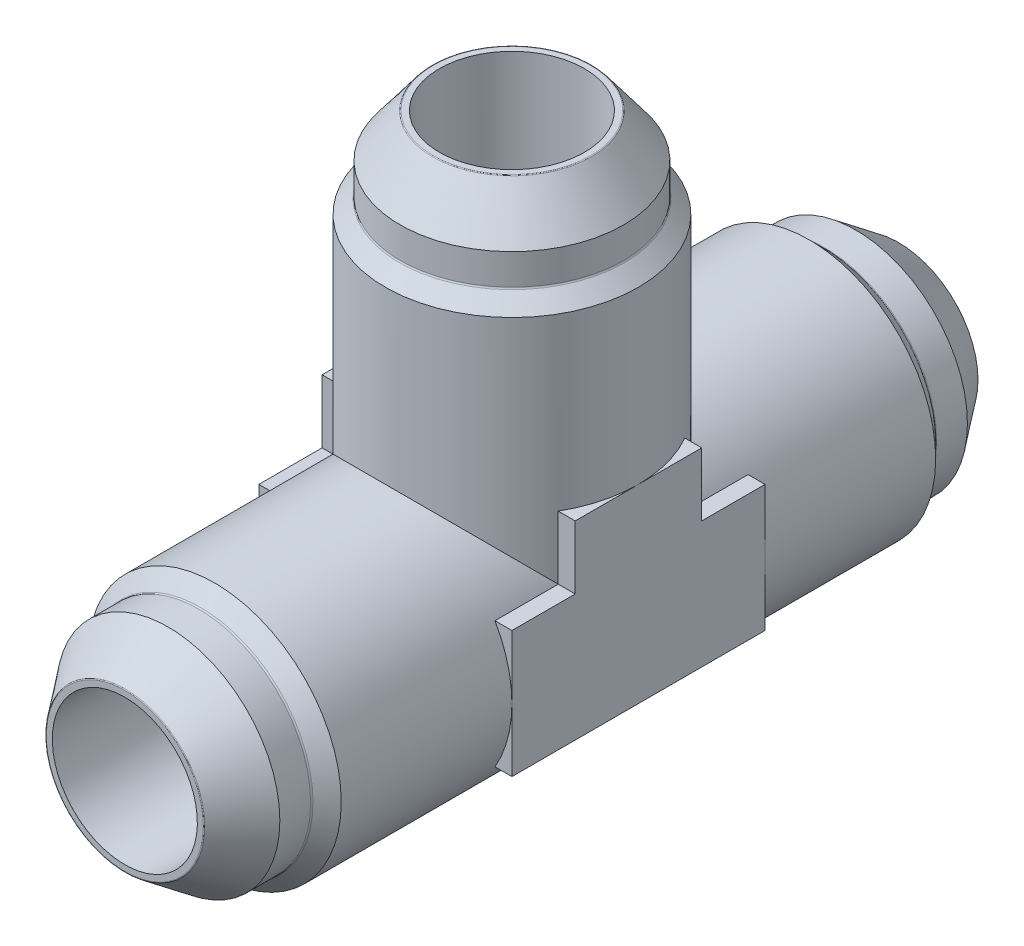
ISO-10303-21;
HEADER;
FILE_DESCRIPTION(('STEP AP214'),'2;1');
FILE_NAME('part.step','',(''),(''),'','','');
FILE_SCHEMA(('AUTOMOTIVE_DESIGN { 1 0 10303 214 1 1 1 1 }'));
ENDSEC;
DATA;
#1=APPLICATION_CONTEXT('core data for automotive mechanical design processes');
#2=APPLICATION_PROTOCOL_DEFINITION('international standard','automotive_design',2000,#1);
#3=PRODUCT_CONTEXT('',#1,'mechanical');
#4=PRODUCT('Part','Part','',(#3));
#5=PRODUCT_RELATED_PRODUCT_CATEGORY('part','',(#4));
#6=PRODUCT_DEFINITION_FORMATION('','',#4);
#7=PRODUCT_DEFINITION_CONTEXT('part definition',#1,'design');
#8=PRODUCT_DEFINITION('design','',#6,#7);
#9=PRODUCT_DEFINITION_SHAPE('','',#8);
#10=(LENGTH_UNIT() NAMED_UNIT(*) SI_UNIT(.MILLI.,.METRE.));
#11=(NAMED_UNIT(*) PLANE_ANGLE_UNIT() SI_UNIT($,.RADIAN.));
#12=(NAMED_UNIT(*) SI_UNIT($,.STERADIAN.) SOLID_ANGLE_UNIT());
#13=UNCERTAINTY_MEASURE_WITH_UNIT(LENGTH_MEASURE(1.E-05),#10,'distance_accuracy_value','');
#14=(GEOMETRIC_REPRESENTATION_CONTEXT(3) GLOBAL_UNCERTAINTY_ASSIGNED_CONTEXT((#13)) GLOBAL_UNIT_ASSIGNED_CONTEXT((#10,
#11,#12)) REPRESENTATION_CONTEXT('',''));
#15=CARTESIAN_POINT('',(0.,0.,0.));
#16=DIRECTION('',(0.,0.,1.));
#17=DIRECTION('',(1.,0.,0.));
#18=AXIS2_PLACEMENT_3D('',#15,#16,#17);
#19=CARTESIAN_POINT('',(0.,19.812,0.));
#20=DIRECTION('',(0.,1.,0.));
#21=DIRECTION('',(1.,0.,0.));
#22=AXIS2_PLACEMENT_3D('',#19,#20,#21);
#23=CYLINDRICAL_SURFACE('',#22,13.49375);
#24=CARTESIAN_POINT('',(0.,31.69285,-1.10654994349755E-13));
#25=DIRECTION('',(0.,1.,0.));
#26=DIRECTION('',(1.,0.,0.));
#27=AXIS2_PLACEMENT_3D('',#24,#25,#26);
#28=CIRCLE('',#27,13.49375);
#29=CARTESIAN_POINT('',(13.49375,31.69285,-1.10654994349755E-13));
#30=VERTEX_POINT('',#29);
#31=EDGE_CURVE('E321',#30,#30,#28,.T.);
#32=ORIENTED_EDGE('',*,*,#31,.F.);
#33=EDGE_LOOP('',(#32));
#34=FACE_BOUND('',#33,.T.);
#35=DIRECTION('',(0.,1.,0.));
#36=VECTOR('',#35,1.);
#37=CARTESIAN_POINT('',(11.6859302923163,19.812,-6.74687499999999));
#38=LINE('',#37,#36);
#39=CARTESIAN_POINT('',(11.6859302923163,6.74687499999998,-6.746875));
#40=VERTEX_POINT('',#39);
#41=CARTESIAN_POINT('',(11.6859302923163,13.49375,-6.746875));
#42=VERTEX_POINT('',#41);
#43=EDGE_CURVE('E274',#40,#42,#38,.T.);
#44=ORIENTED_EDGE('',*,*,#43,.F.);
#45=CARTESIAN_POINT('',(0.,0.,0.));
#46=DIRECTION('',(0.,0.707106781186549,0.707106781186546));
#47=DIRECTION('',(0.,0.707106781186546,-0.707106781186549));
#48=AXIS2_PLACEMENT_3D('',#45,#46,#47);
#49=ELLIPSE('',#48,19.083044257272,13.49375);
#50=CARTESIAN_POINT('',(-11.6859302923163,6.74687499999998,-6.746875));
#51=VERTEX_POINT('',#50);
#52=EDGE_CURVE('E312',#51,#40,#49,.F.);
#53=ORIENTED_EDGE('',*,*,#52,.F.);
#54=DIRECTION('',(0.,1.,0.));
#55=VECTOR('',#54,1.);
#56=CARTESIAN_POINT('',(-11.6859302923163,19.812,-6.74687499999999));
#57=LINE('',#56,#55);
#58=CARTESIAN_POINT('',(-11.6859302923163,13.49375,-6.746875));
#59=VERTEX_POINT('',#58);
#60=EDGE_CURVE('E271',#59,#51,#57,.F.);
#61=ORIENTED_EDGE('',*,*,#60,.F.);
#62=CARTESIAN_POINT('',(0.,13.49375,0.));
#63=DIRECTION('',(0.,-1.,0.));
#64=DIRECTION('',(0.,0.,-1.));
#65=AXIS2_PLACEMENT_3D('',#62,#63,#64);
#66=CIRCLE('',#65,13.49375);
#67=CARTESIAN_POINT('',(-13.49375,13.49375,0.));
#68=VERTEX_POINT('',#67);
#69=EDGE_CURVE('E364',#68,#59,#66,.T.);
#70=ORIENTED_EDGE('',*,*,#69,.F.);
#71=CARTESIAN_POINT('',(-11.6859302923162,13.49375,6.74687500000002));
#72=VERTEX_POINT('',#71);
#73=EDGE_CURVE('E57',#72,#68,#66,.T.);
#74=ORIENTED_EDGE('',*,*,#73,.F.);
#75=DIRECTION('',(0.,1.,0.));
#76=VECTOR('',#75,1.);
#77=CARTESIAN_POINT('',(-11.6859302923162,19.812,6.746875));
#78=LINE('',#77,#76);
#79=CARTESIAN_POINT('',(-11.6859302923163,6.746875,6.74687499999998));
#80=VERTEX_POINT('',#79);
#81=EDGE_CURVE('E269',#80,#72,#78,.T.);
#82=ORIENTED_EDGE('',*,*,#81,.F.);
#83=CARTESIAN_POINT('',(0.,0.,0.));
#84=DIRECTION('',(0.,0.707106781186546,-0.707106781186549));
#85=DIRECTION('',(0.,0.707106781186549,0.707106781186546));
#86=AXIS2_PLACEMENT_3D('',#83,#84,#85);
#87=ELLIPSE('',#86,19.0830442572719,13.49375);
#88=CARTESIAN_POINT('',(11.6859302923163,6.746875,6.74687499999998));
#89=VERTEX_POINT('',#88);
#90=EDGE_CURVE('E315',#89,#80,#87,.F.);
#91=ORIENTED_EDGE('',*,*,#90,.F.);
#92=DIRECTION('',(0.,1.,0.));
#93=VECTOR('',#92,1.);
#94=CARTESIAN_POINT('',(11.6859302923162,19.812,6.746875));
#95=LINE('',#94,#93);
#96=CARTESIAN_POINT('',(11.6859302923162,13.49375,6.746875));
#97=VERTEX_POINT('',#96);
#98=EDGE_CURVE('E266',#97,#89,#95,.F.);
#99=ORIENTED_EDGE('',*,*,#98,.F.);
#100=CARTESIAN_POINT('',(13.49375,13.49375,0.));
#101=VERTEX_POINT('',#100);
#102=EDGE_CURVE('E366',#101,#97,#66,.T.);
#103=ORIENTED_EDGE('',*,*,#102,.F.);
#104=EDGE_CURVE('E44',#42,#101,#66,.T.);
#105=ORIENTED_EDGE('',*,*,#104,.F.);
#106=EDGE_LOOP('',(#44,#53,#61,#70,#74,#82,#91,#99,#103,#105));
#107=FACE_BOUND('',#106,.T.);
#108=ADVANCED_FACE('F36',(#34,#107),#23,.T.);
#109=CARTESIAN_POINT('',(0.,0.,-19.812));
#110=DIRECTION('',(0.,0.,-1.));
#111=DIRECTION('',(1.,0.,0.));
#112=AXIS2_PLACEMENT_3D('',#109,#110,#111);
#113=CYLINDRICAL_SURFACE('',#112,13.49375);
#114=CARTESIAN_POINT('',(0.,0.,-31.69285));
#115=DIRECTION('',(0.,0.,-1.));
#116=DIRECTION('',(1.,0.,0.));
#117=AXIS2_PLACEMENT_3D('',#114,#115,#116);
#118=CIRCLE('',#117,13.49375);
#119=CARTESIAN_POINT('',(13.49375,0.,-31.69285));
#120=VERTEX_POINT('',#119);
#121=EDGE_CURVE('E297',#120,#120,#118,.T.);
#122=ORIENTED_EDGE('',*,*,#121,.F.);
#123=EDGE_LOOP('',(#122));
#124=FACE_BOUND('',#123,.T.);
#125=CARTESIAN_POINT('',(0.,0.,31.69285));
#126=DIRECTION('',(0.,0.,1.));
#127=DIRECTION('',(1.,0.,0.));
#128=AXIS2_PLACEMENT_3D('',#125,#126,#127);
#129=CIRCLE('',#128,13.49375);
#130=CARTESIAN_POINT('',(13.49375,0.,31.69285));
#131=VERTEX_POINT('',#130);
#132=EDGE_CURVE('E279',#131,#131,#129,.T.);
#133=ORIENTED_EDGE('',*,*,#132,.F.);
#134=EDGE_LOOP('',(#133));
#135=FACE_BOUND('',#134,.T.);
#136=CARTESIAN_POINT('',(0.,0.,-13.49375));
#137=DIRECTION('',(0.,0.,1.));
#138=DIRECTION('',(0.,-1.,0.));
#139=AXIS2_PLACEMENT_3D('',#136,#137,#138);
#140=CIRCLE('',#139,13.49375);
#141=CARTESIAN_POINT('',(-11.6859302923163,6.746875,-13.49375));
#142=VERTEX_POINT('',#141);
#143=CARTESIAN_POINT('',(-13.49375,0.,-13.49375));
#144=VERTEX_POINT('',#143);
#145=EDGE_CURVE('E348',#142,#144,#140,.T.);
#146=ORIENTED_EDGE('',*,*,#145,.F.);
#147=DIRECTION('',(0.,0.,-1.));
#148=VECTOR('',#147,1.);
#149=CARTESIAN_POINT('',(-11.6859302923163,6.746875,-19.812));
#150=LINE('',#149,#148);
#151=EDGE_CURVE('E362',#51,#142,#150,.T.);
#152=ORIENTED_EDGE('',*,*,#151,.F.);
#153=ORIENTED_EDGE('',*,*,#52,.T.);
#154=DIRECTION('',(0.,0.,-1.));
#155=VECTOR('',#154,1.);
#156=CARTESIAN_POINT('',(11.6859302923163,6.746875,-19.812));
#157=LINE('',#156,#155);
#158=CARTESIAN_POINT('',(11.6859302923163,6.746875,-13.49375));
#159=VERTEX_POINT('',#158);
#160=EDGE_CURVE('E355',#159,#40,#157,.F.);
#161=ORIENTED_EDGE('',*,*,#160,.F.);
#162=CARTESIAN_POINT('',(13.49375,0.,-13.49375));
#163=VERTEX_POINT('',#162);
#164=EDGE_CURVE('E349',#163,#159,#140,.T.);
#165=ORIENTED_EDGE('',*,*,#164,.F.);
#166=CARTESIAN_POINT('',(11.6859302923163,-6.746875,-13.49375));
#167=VERTEX_POINT('',#166);
#168=EDGE_CURVE('E358',#167,#163,#140,.T.);
#169=ORIENTED_EDGE('',*,*,#168,.F.);
#170=DIRECTION('',(0.,0.,-1.));
#171=VECTOR('',#170,1.);
#172=CARTESIAN_POINT('',(11.6859302923163,-6.74687499999999,-19.812));
#173=LINE('',#172,#171);
#174=CARTESIAN_POINT('',(11.6859302923163,-6.746875,13.49375));
#175=VERTEX_POINT('',#174);
#176=EDGE_CURVE('E352',#175,#167,#173,.T.);
#177=ORIENTED_EDGE('',*,*,#176,.F.);
#178=CARTESIAN_POINT('',(0.,0.,13.49375));
#179=DIRECTION('',(0.,0.,-1.));
#180=DIRECTION('',(0.,1.,0.));
#181=AXIS2_PLACEMENT_3D('',#178,#179,#180);
#182=CIRCLE('',#181,13.49375);
#183=CARTESIAN_POINT('',(13.49375,0.,13.49375));
#184=VERTEX_POINT('',#183);
#185=EDGE_CURVE('E456',#184,#175,#182,.T.);
#186=ORIENTED_EDGE('',*,*,#185,.F.);
#187=CARTESIAN_POINT('',(11.6859302923163,6.746875,13.49375));
#188=VERTEX_POINT('',#187);
#189=EDGE_CURVE('E340',#188,#184,#182,.T.);
#190=ORIENTED_EDGE('',*,*,#189,.F.);
#191=DIRECTION('',(0.,0.,-1.));
#192=VECTOR('',#191,1.);
#193=CARTESIAN_POINT('',(11.6859302923163,6.746875,-19.812));
#194=LINE('',#193,#192);
#195=EDGE_CURVE('E359',#89,#188,#194,.F.);
#196=ORIENTED_EDGE('',*,*,#195,.F.);
#197=ORIENTED_EDGE('',*,*,#90,.T.);
#198=DIRECTION('',(0.,0.,-1.));
#199=VECTOR('',#198,1.);
#200=CARTESIAN_POINT('',(-11.6859302923163,6.746875,-19.812));
#201=LINE('',#200,#199);
#202=CARTESIAN_POINT('',(-11.6859302923163,6.746875,13.49375));
#203=VERTEX_POINT('',#202);
#204=EDGE_CURVE('E339',#203,#80,#201,.T.);
#205=ORIENTED_EDGE('',*,*,#204,.F.);
#206=CARTESIAN_POINT('',(-13.49375,0.,13.49375));
#207=VERTEX_POINT('',#206);
#208=EDGE_CURVE('E336',#207,#203,#182,.T.);
#209=ORIENTED_EDGE('',*,*,#208,.F.);
#210=CARTESIAN_POINT('',(-11.6859302923163,-6.746875,13.49375));
#211=VERTEX_POINT('',#210);
#212=EDGE_CURVE('E341',#211,#207,#182,.T.);
#213=ORIENTED_EDGE('',*,*,#212,.F.);
#214=DIRECTION('',(0.,0.,-1.));
#215=VECTOR('',#214,1.);
#216=CARTESIAN_POINT('',(-11.6859302923163,-6.74687499999999,-19.812));
#217=LINE('',#216,#215);
#218=CARTESIAN_POINT('',(-11.6859302923163,-6.746875,-13.49375));
#219=VERTEX_POINT('',#218);
#220=EDGE_CURVE('E347',#219,#211,#217,.F.);
#221=ORIENTED_EDGE('',*,*,#220,.F.);
#222=EDGE_CURVE('E344',#144,#219,#140,.T.);
#223=ORIENTED_EDGE('',*,*,#222,.F.);
#224=EDGE_LOOP('',(#146,#152,#153,#161,#165,#169,#177,#186,#190,#196,#197,#205,#209,#213,#221,#223));
#225=FACE_BOUND('',#224,.T.);
#226=ADVANCED_FACE('F399',(#124,#135,#225),#113,.T.);
#227=CARTESIAN_POINT('',(0.,41.148,-1.43667474130717E-13));
#228=DIRECTION('',(0.,1.,0.));
#229=DIRECTION('',(1.,0.,0.));
#230=AXIS2_PLACEMENT_3D('',#227,#228,#229);
#231=TOROIDAL_SURFACE('',#230,8.36948013577722,0.126999999999997);
#232=CARTESIAN_POINT('',(0.,41.275,-1.4411089226075E-13));
#233=DIRECTION('',(0.,1.,0.));
#234=DIRECTION('',(1.,0.,0.));
#235=AXIS2_PLACEMENT_3D('',#232,#233,#234);
#236=CIRCLE('',#235,8.36948013577722);
#237=CARTESIAN_POINT('',(8.36948013577722,41.275,-1.4411089226075E-13));
#238=VERTEX_POINT('',#237);
#239=EDGE_CURVE('E318',#238,#238,#236,.T.);
#240=ORIENTED_EDGE('',*,*,#239,.F.);
#241=EDGE_LOOP('',(#240));
#242=FACE_BOUND('',#241,.T.);
#243=CARTESIAN_POINT('',(0.,41.2244305079403,-1.43934329822909E-13));
#244=DIRECTION('',(0.,1.,0.));
#245=DIRECTION('',(1.,0.,0.));
#246=AXIS2_PLACEMENT_3D('',#243,#244,#245);
#247=CIRCLE('',#246,8.47090684555323);
#248=CARTESIAN_POINT('',(8.47090684555323,41.2244305079403,-1.43934329822909E-13));
#249=VERTEX_POINT('',#248);
#250=EDGE_CURVE('E333',#249,#249,#247,.T.);
#251=ORIENTED_EDGE('',*,*,#250,.T.);
#252=EDGE_LOOP('',(#251));
#253=FACE_BOUND('',#252,.T.);
#254=ADVANCED_FACE('F38',(#242,#253),#231,.T.);
#255=CARTESIAN_POINT('',(0.,36.6571494297253,-1.2798775316907E-13));
#256=DIRECTION('',(0.,-1.,0.));
#257=DIRECTION('',(-1.,0.,0.));
#258=AXIS2_PLACEMENT_3D('',#255,#256,#257);
#259=CONICAL_SURFACE('',#258,11.9126,0.645771823237904);
#260=ORIENTED_EDGE('',*,*,#250,.F.);
#261=EDGE_LOOP('',(#260));
#262=FACE_BOUND('',#261,.T.);
#263=CARTESIAN_POINT('',(0.,36.6571494297253,-1.2798775316907E-13));
#264=DIRECTION('',(0.,1.,0.));
#265=DIRECTION('',(1.,0.,0.));
#266=AXIS2_PLACEMENT_3D('',#263,#264,#265);
#267=CIRCLE('',#266,11.9126);
#268=CARTESIAN_POINT('',(11.9126,36.6571494297253,-1.2798775316907E-13));
#269=VERTEX_POINT('',#268);
#270=EDGE_CURVE('E330',#269,#269,#267,.T.);
#271=ORIENTED_EDGE('',*,*,#270,.T.);
#272=EDGE_LOOP('',(#271));
#273=FACE_BOUND('',#272,.T.);
#274=ADVANCED_FACE('F500',(#262,#273),#259,.T.);
#275=CARTESIAN_POINT('',(0.,19.812,0.));
#276=DIRECTION('',(0.,1.,0.));
#277=DIRECTION('',(1.,0.,0.));
#278=AXIS2_PLACEMENT_3D('',#275,#276,#277);
#279=CYLINDRICAL_SURFACE('',#278,11.9126);
#280=ORIENTED_EDGE('',*,*,#270,.F.);
#281=EDGE_LOOP('',(#280));
#282=FACE_BOUND('',#281,.T.);
#283=CARTESIAN_POINT('',(0.,33.3792102448428,-1.1654288967519E-13));
#284=DIRECTION('',(0.,1.,0.));
#285=DIRECTION('',(1.,0.,0.));
#286=AXIS2_PLACEMENT_3D('',#283,#284,#285);
#287=CIRCLE('',#286,11.9126);
#288=CARTESIAN_POINT('',(11.9126,33.3792102448428,-1.1654288967519E-13));
#289=VERTEX_POINT('',#288);
#290=EDGE_CURVE('E327',#289,#289,#287,.T.);
#291=ORIENTED_EDGE('',*,*,#290,.T.);
#292=EDGE_LOOP('',(#291));
#293=FACE_BOUND('',#292,.T.);
#294=ADVANCED_FACE('F497',(#282,#293),#279,.T.);
#295=CARTESIAN_POINT('',(0.,33.3792102448428,-1.1654288967519E-13));
#296=DIRECTION('',(0.,1.,0.));
#297=DIRECTION('',(1.,0.,0.));
#298=AXIS2_PLACEMENT_3D('',#295,#296,#297);
#299=TOROIDAL_SURFACE('',#298,12.1666,0.254000000000002);
#300=ORIENTED_EDGE('',*,*,#290,.F.);
#301=EDGE_LOOP('',(#300));
#302=FACE_BOUND('',#301,.T.);
#303=CARTESIAN_POINT('',(0.,33.1996051224214,-1.15915801741895E-13));
#304=DIRECTION('',(0.,1.,0.));
#305=DIRECTION('',(1.,0.,0.));
#306=AXIS2_PLACEMENT_3D('',#303,#304,#305);
#307=CIRCLE('',#306,11.9869948775786);
#308=CARTESIAN_POINT('',(11.9869948775786,33.1996051224214,-1.15915801741895E-13));
#309=VERTEX_POINT('',#308);
#310=EDGE_CURVE('E324',#309,#309,#307,.T.);
#311=ORIENTED_EDGE('',*,*,#310,.T.);
#312=EDGE_LOOP('',(#311));
#313=FACE_BOUND('',#312,.T.);
#314=ADVANCED_FACE('F493',(#302,#313),#299,.F.);
#315=CARTESIAN_POINT('',(0.,31.69285,-1.10654994349755E-13));
#316=DIRECTION('',(0.,-1.,0.));
#317=DIRECTION('',(-1.,0.,0.));
#318=AXIS2_PLACEMENT_3D('',#315,#316,#317);
#319=CONICAL_SURFACE('',#318,13.49375,0.785398163397451);
#320=ORIENTED_EDGE('',*,*,#310,.F.);
#321=EDGE_LOOP('',(#320));
#322=FACE_BOUND('',#321,.T.);
#323=ORIENTED_EDGE('',*,*,#31,.T.);
#324=EDGE_LOOP('',(#323));
#325=FACE_BOUND('',#324,.T.);
#326=ADVANCED_FACE('F490',(#322,#325),#319,.T.);
#327=CARTESIAN_POINT('',(0.,41.275,-1.4411089226075E-13));
#328=DIRECTION('',(0.,-1.,0.));
#329=DIRECTION('',(-1.,0.,0.));
#330=AXIS2_PLACEMENT_3D('',#327,#328,#329);
#331=PLANE('',#330);
#332=CARTESIAN_POINT('',(0.,41.275,-1.38410679545105E-13));
#333=DIRECTION('',(0.,-1.,0.));
#334=DIRECTION('',(0.,0.,-1.));
#335=AXIS2_PLACEMENT_3D('',#332,#333,#334);
#336=CIRCLE('',#335,7.73430000000001);
#337=CARTESIAN_POINT('',(0.,41.275,-7.73430000000014));
#338=VERTEX_POINT('',#337);
#339=EDGE_CURVE('E176',#338,#338,#336,.T.);
#340=ORIENTED_EDGE('',*,*,#339,.T.);
#341=EDGE_LOOP('',(#340));
#342=FACE_BOUND('',#341,.T.);
#343=ORIENTED_EDGE('',*,*,#239,.T.);
#344=EDGE_LOOP('',(#343));
#345=FACE_BOUND('',#344,.T.);
#346=ADVANCED_FACE('F488',(#342,#345),#331,.F.);
#347=CARTESIAN_POINT('',(0.,0.,-41.148));
#348=DIRECTION('',(0.,0.,-1.));
#349=DIRECTION('',(1.,0.,0.));
#350=AXIS2_PLACEMENT_3D('',#347,#348,#349);
#351=TOROIDAL_SURFACE('',#350,8.36948013577722,0.126999999999997);
#352=CARTESIAN_POINT('',(0.,0.,-41.275));
#353=DIRECTION('',(0.,0.,-1.));
#354=DIRECTION('',(1.,0.,0.));
#355=AXIS2_PLACEMENT_3D('',#352,#353,#354);
#356=CIRCLE('',#355,8.36948013577722);
#357=CARTESIAN_POINT('',(8.36948013577722,0.,-41.275));
#358=VERTEX_POINT('',#357);
#359=EDGE_CURVE('E294',#358,#358,#356,.T.);
#360=ORIENTED_EDGE('',*,*,#359,.F.);
#361=EDGE_LOOP('',(#360));
#362=FACE_BOUND('',#361,.T.);
#363=CARTESIAN_POINT('',(0.,0.,-41.2244305079403));
#364=DIRECTION('',(0.,0.,-1.));
#365=DIRECTION('',(1.,0.,0.));
#366=AXIS2_PLACEMENT_3D('',#363,#364,#365);
#367=CIRCLE('',#366,8.47090684555323);
#368=CARTESIAN_POINT('',(8.47090684555323,0.,-41.2244305079403));
#369=VERTEX_POINT('',#368);
#370=EDGE_CURVE('E309',#369,#369,#367,.T.);
#371=ORIENTED_EDGE('',*,*,#370,.T.);
#372=EDGE_LOOP('',(#371));
#373=FACE_BOUND('',#372,.T.);
#374=ADVANCED_FACE('F522',(#362,#373),#351,.T.);
#375=CARTESIAN_POINT('',(0.,0.,-36.6571494297253));
#376=DIRECTION('',(0.,0.,1.));
#377=DIRECTION('',(-1.,0.,0.));
#378=AXIS2_PLACEMENT_3D('',#375,#376,#377);
#379=CONICAL_SURFACE('',#378,11.9126,0.645771823237904);
#380=ORIENTED_EDGE('',*,*,#370,.F.);
#381=EDGE_LOOP('',(#380));
#382=FACE_BOUND('',#381,.T.);
#383=CARTESIAN_POINT('',(0.,0.,-36.6571494297253));
#384=DIRECTION('',(0.,0.,-1.));
#385=DIRECTION('',(1.,0.,0.));
#386=AXIS2_PLACEMENT_3D('',#383,#384,#385);
#387=CIRCLE('',#386,11.9126);
#388=CARTESIAN_POINT('',(11.9126,0.,-36.6571494297253));
#389=VERTEX_POINT('',#388);
#390=EDGE_CURVE('E306',#389,#389,#387,.T.);
#391=ORIENTED_EDGE('',*,*,#390,.T.);
#392=EDGE_LOOP('',(#391));
#393=FACE_BOUND('',#392,.T.);
#394=ADVANCED_FACE('F527',(#382,#393),#379,.T.);
#395=CARTESIAN_POINT('',(0.,0.,-19.812));
#396=DIRECTION('',(0.,0.,-1.));
#397=DIRECTION('',(1.,0.,0.));
#398=AXIS2_PLACEMENT_3D('',#395,#396,#397);
#399=CYLINDRICAL_SURFACE('',#398,11.9126);
#400=ORIENTED_EDGE('',*,*,#390,.F.);
#401=EDGE_LOOP('',(#400));
#402=FACE_BOUND('',#401,.T.);
#403=CARTESIAN_POINT('',(0.,0.,-33.3792102448428));
#404=DIRECTION('',(0.,0.,-1.));
#405=DIRECTION('',(1.,0.,0.));
#406=AXIS2_PLACEMENT_3D('',#403,#404,#405);
#407=CIRCLE('',#406,11.9126);
#408=CARTESIAN_POINT('',(11.9126,0.,-33.3792102448428));
#409=VERTEX_POINT('',#408);
#410=EDGE_CURVE('E303',#409,#409,#407,.T.);
#411=ORIENTED_EDGE('',*,*,#410,.T.);
#412=EDGE_LOOP('',(#411));
#413=FACE_BOUND('',#412,.T.);
#414=ADVANCED_FACE('F586',(#402,#413),#399,.T.);
#415=CARTESIAN_POINT('',(0.,0.,-33.3792102448428));
#416=DIRECTION('',(0.,0.,-1.));
#417=DIRECTION('',(1.,0.,0.));
#418=AXIS2_PLACEMENT_3D('',#415,#416,#417);
#419=TOROIDAL_SURFACE('',#418,12.1666,0.254000000000002);
#420=ORIENTED_EDGE('',*,*,#410,.F.);
#421=EDGE_LOOP('',(#420));
#422=FACE_BOUND('',#421,.T.);
#423=CARTESIAN_POINT('',(0.,0.,-33.1996051224214));
#424=DIRECTION('',(0.,0.,-1.));
#425=DIRECTION('',(1.,0.,0.));
#426=AXIS2_PLACEMENT_3D('',#423,#424,#425);
#427=CIRCLE('',#426,11.9869948775786);
#428=CARTESIAN_POINT('',(11.9869948775786,0.,-33.1996051224214));
#429=VERTEX_POINT('',#428);
#430=EDGE_CURVE('E300',#429,#429,#427,.T.);
#431=ORIENTED_EDGE('',*,*,#430,.T.);
#432=EDGE_LOOP('',(#431));
#433=FACE_BOUND('',#432,.T.);
#434=ADVANCED_FACE('F582',(#422,#433),#419,.F.);
#435=CARTESIAN_POINT('',(0.,0.,-31.69285));
#436=DIRECTION('',(0.,0.,1.));
#437=DIRECTION('',(-1.,0.,0.));
#438=AXIS2_PLACEMENT_3D('',#435,#436,#437);
#439=CONICAL_SURFACE('',#438,13.49375,0.785398163397451);
#440=ORIENTED_EDGE('',*,*,#430,.F.);
#441=EDGE_LOOP('',(#440));
#442=FACE_BOUND('',#441,.T.);
#443=ORIENTED_EDGE('',*,*,#121,.T.);
#444=EDGE_LOOP('',(#443));
#445=FACE_BOUND('',#444,.T.);
#446=ADVANCED_FACE('F577',(#442,#445),#439,.T.);
#447=CARTESIAN_POINT('',(0.,0.,-41.275));
#448=DIRECTION('',(0.,0.,1.));
#449=DIRECTION('',(-1.,0.,0.));
#450=AXIS2_PLACEMENT_3D('',#447,#448,#449);
#451=PLANE('',#450);
#452=CARTESIAN_POINT('',(0.,0.,-41.275));
#453=DIRECTION('',(0.,0.,1.));
#454=DIRECTION('',(0.,-1.,0.));
#455=AXIS2_PLACEMENT_3D('',#452,#453,#454);
#456=CIRCLE('',#455,7.73430000000001);
#457=CARTESIAN_POINT('',(0.,-7.7343,-41.275));
#458=VERTEX_POINT('',#457);
#459=EDGE_CURVE('E182',#458,#458,#456,.T.);
#460=ORIENTED_EDGE('',*,*,#459,.T.);
#461=EDGE_LOOP('',(#460));
#462=FACE_BOUND('',#461,.T.);
#463=ORIENTED_EDGE('',*,*,#359,.T.);
#464=EDGE_LOOP('',(#463));
#465=FACE_BOUND('',#464,.T.);
#466=ADVANCED_FACE('F574',(#462,#465),#451,.F.);
#467=CARTESIAN_POINT('',(0.,0.,41.148));
#468=DIRECTION('',(0.,0.,1.));
#469=DIRECTION('',(1.,0.,0.));
#470=AXIS2_PLACEMENT_3D('',#467,#468,#469);
#471=TOROIDAL_SURFACE('',#470,8.36948013577722,0.126999999999997);
#472=CARTESIAN_POINT('',(0.,0.,41.275));
#473=DIRECTION('',(0.,0.,1.));
#474=DIRECTION('',(1.,0.,0.));
#475=AXIS2_PLACEMENT_3D('',#472,#473,#474);
#476=CIRCLE('',#475,8.36948013577722);
#477=CARTESIAN_POINT('',(8.36948013577722,0.,41.275));
#478=VERTEX_POINT('',#477);
#479=EDGE_CURVE('E276',#478,#478,#476,.T.);
#480=ORIENTED_EDGE('',*,*,#479,.F.);
#481=EDGE_LOOP('',(#480));
#482=FACE_BOUND('',#481,.T.);
#483=CARTESIAN_POINT('',(0.,0.,41.2244305079403));
#484=DIRECTION('',(0.,0.,1.));
#485=DIRECTION('',(1.,0.,0.));
#486=AXIS2_PLACEMENT_3D('',#483,#484,#485);
#487=CIRCLE('',#486,8.47090684555323);
#488=CARTESIAN_POINT('',(8.47090684555323,0.,41.2244305079403));
#489=VERTEX_POINT('',#488);
#490=EDGE_CURVE('E291',#489,#489,#487,.T.);
#491=ORIENTED_EDGE('',*,*,#490,.T.);
#492=EDGE_LOOP('',(#491));
#493=FACE_BOUND('',#492,.T.);
#494=ADVANCED_FACE('F570',(#482,#493),#471,.T.);
#495=CARTESIAN_POINT('',(0.,0.,36.6571494297253));
#496=DIRECTION('',(0.,0.,-1.));
#497=DIRECTION('',(-1.,0.,0.));
#498=AXIS2_PLACEMENT_3D('',#495,#496,#497);
#499=CONICAL_SURFACE('',#498,11.9126,0.645771823237904);
#500=ORIENTED_EDGE('',*,*,#490,.F.);
#501=EDGE_LOOP('',(#500));
#502=FACE_BOUND('',#501,.T.);
#503=CARTESIAN_POINT('',(0.,0.,36.6571494297253));
#504=DIRECTION('',(0.,0.,1.));
#505=DIRECTION('',(1.,0.,0.));
#506=AXIS2_PLACEMENT_3D('',#503,#504,#505);
#507=CIRCLE('',#506,11.9126);
#508=CARTESIAN_POINT('',(11.9126,0.,36.6571494297253));
#509=VERTEX_POINT('',#508);
#510=EDGE_CURVE('E288',#509,#509,#507,.T.);
#511=ORIENTED_EDGE('',*,*,#510,.T.);
#512=EDGE_LOOP('',(#511));
#513=FACE_BOUND('',#512,.T.);
#514=ADVANCED_FACE('F566',(#502,#513),#499,.T.);
#515=CARTESIAN_POINT('',(0.,0.,19.812));
#516=DIRECTION('',(0.,0.,1.));
#517=DIRECTION('',(1.,0.,0.));
#518=AXIS2_PLACEMENT_3D('',#515,#516,#517);
#519=CYLINDRICAL_SURFACE('',#518,11.9126);
#520=ORIENTED_EDGE('',*,*,#510,.F.);
#521=EDGE_LOOP('',(#520));
#522=FACE_BOUND('',#521,.T.);
#523=CARTESIAN_POINT('',(0.,0.,33.3792102448428));
#524=DIRECTION('',(0.,0.,1.));
#525=DIRECTION('',(1.,0.,0.));
#526=AXIS2_PLACEMENT_3D('',#523,#524,#525);
#527=CIRCLE('',#526,11.9126);
#528=CARTESIAN_POINT('',(11.9126,0.,33.3792102448428));
#529=VERTEX_POINT('',#528);
#530=EDGE_CURVE('E285',#529,#529,#527,.T.);
#531=ORIENTED_EDGE('',*,*,#530,.T.);
#532=EDGE_LOOP('',(#531));
#533=FACE_BOUND('',#532,.T.);
#534=ADVANCED_FACE('F562',(#522,#533),#519,.T.);
#535=CARTESIAN_POINT('',(0.,0.,33.3792102448428));
#536=DIRECTION('',(0.,0.,1.));
#537=DIRECTION('',(1.,0.,0.));
#538=AXIS2_PLACEMENT_3D('',#535,#536,#537);
#539=TOROIDAL_SURFACE('',#538,12.1666,0.254000000000002);
#540=ORIENTED_EDGE('',*,*,#530,.F.);
#541=EDGE_LOOP('',(#540));
#542=FACE_BOUND('',#541,.T.);
#543=CARTESIAN_POINT('',(0.,0.,33.1996051224214));
#544=DIRECTION('',(0.,0.,1.));
#545=DIRECTION('',(1.,0.,0.));
#546=AXIS2_PLACEMENT_3D('',#543,#544,#545);
#547=CIRCLE('',#546,11.9869948775786);
#548=CARTESIAN_POINT('',(11.9869948775786,0.,33.1996051224214));
#549=VERTEX_POINT('',#548);
#550=EDGE_CURVE('E282',#549,#549,#547,.T.);
#551=ORIENTED_EDGE('',*,*,#550,.T.);
#552=EDGE_LOOP('',(#551));
#553=FACE_BOUND('',#552,.T.);
#554=ADVANCED_FACE('F553',(#542,#553),#539,.F.);
#555=CARTESIAN_POINT('',(0.,0.,31.69285));
#556=DIRECTION('',(0.,0.,-1.));
#557=DIRECTION('',(-1.,0.,0.));
#558=AXIS2_PLACEMENT_3D('',#555,#556,#557);
#559=CONICAL_SURFACE('',#558,13.49375,0.785398163397451);
#560=ORIENTED_EDGE('',*,*,#550,.F.);
#561=EDGE_LOOP('',(#560));
#562=FACE_BOUND('',#561,.T.);
#563=ORIENTED_EDGE('',*,*,#132,.T.);
#564=EDGE_LOOP('',(#563));
#565=FACE_BOUND('',#564,.T.);
#566=ADVANCED_FACE('F547',(#562,#565),#559,.T.);
#567=CARTESIAN_POINT('',(0.,0.,41.275));
#568=DIRECTION('',(0.,0.,-1.));
#569=DIRECTION('',(-1.,0.,0.));
#570=AXIS2_PLACEMENT_3D('',#567,#568,#569);
#571=PLANE('',#570);
#572=CARTESIAN_POINT('',(0.,0.,41.275));
#573=DIRECTION('',(0.,0.,-1.));
#574=DIRECTION('',(0.,1.,0.));
#575=AXIS2_PLACEMENT_3D('',#572,#573,#574);
#576=CIRCLE('',#575,7.73430000000001);
#577=CARTESIAN_POINT('',(0.,7.7343,41.275));
#578=VERTEX_POINT('',#577);
#579=EDGE_CURVE('E175',#578,#578,#576,.T.);
#580=ORIENTED_EDGE('',*,*,#579,.T.);
#581=EDGE_LOOP('',(#580));
#582=FACE_BOUND('',#581,.T.);
#583=ORIENTED_EDGE('',*,*,#479,.T.);
#584=EDGE_LOOP('',(#583));
#585=FACE_BOUND('',#584,.T.);
#586=ADVANCED_FACE('F542',(#582,#585),#571,.F.);
#587=CARTESIAN_POINT('',(-13.49375,-6.746875,-13.49375));
#588=DIRECTION('',(1.,0.,0.));
#589=DIRECTION('',(0.,0.,-1.));
#590=AXIS2_PLACEMENT_3D('',#587,#588,#589);
#591=PLANE('',#590);
#592=DIRECTION('',(0.,0.,1.));
#593=VECTOR('',#592,1.);
#594=CARTESIAN_POINT('',(-13.49375,13.49375,6.746875));
#595=LINE('',#594,#593);
#596=CARTESIAN_POINT('',(-13.49375,13.49375,6.746875));
#597=VERTEX_POINT('',#596);
#598=EDGE_CURVE('E218',#68,#597,#595,.T.);
#599=ORIENTED_EDGE('',*,*,#598,.F.);
#600=CARTESIAN_POINT('',(-13.49375,13.49375,-6.746875));
#601=VERTEX_POINT('',#600);
#602=EDGE_CURVE('E219',#601,#68,#595,.T.);
#603=ORIENTED_EDGE('',*,*,#602,.F.);
#604=DIRECTION('',(0.,1.,0.));
#605=VECTOR('',#604,1.);
#606=CARTESIAN_POINT('',(-13.49375,13.49375,-6.746875));
#607=LINE('',#606,#605);
#608=CARTESIAN_POINT('',(-13.49375,6.746875,-6.746875));
#609=VERTEX_POINT('',#608);
#610=EDGE_CURVE('E215',#609,#601,#607,.T.);
#611=ORIENTED_EDGE('',*,*,#610,.F.);
#612=DIRECTION('',(0.,0.,1.));
#613=VECTOR('',#612,1.);
#614=CARTESIAN_POINT('',(-13.49375,6.746875,-6.746875));
#615=LINE('',#614,#613);
#616=CARTESIAN_POINT('',(-13.49375,6.746875,-13.49375));
#617=VERTEX_POINT('',#616);
#618=EDGE_CURVE('E212',#617,#609,#615,.T.);
#619=ORIENTED_EDGE('',*,*,#618,.F.);
#620=DIRECTION('',(0.,1.,0.));
#621=VECTOR('',#620,1.);
#622=CARTESIAN_POINT('',(-13.49375,6.746875,-13.49375));
#623=LINE('',#622,#621);
#624=EDGE_CURVE('E179',#144,#617,#623,.T.);
#625=ORIENTED_EDGE('',*,*,#624,.F.);
#626=CARTESIAN_POINT('',(-13.49375,-6.746875,-13.49375));
#627=VERTEX_POINT('',#626);
#628=EDGE_CURVE('E209',#627,#144,#623,.T.);
#629=ORIENTED_EDGE('',*,*,#628,.F.);
#630=DIRECTION('',(0.,0.,-1.));
#631=VECTOR('',#630,1.);
#632=CARTESIAN_POINT('',(-13.49375,-6.746875,13.49375));
#633=LINE('',#632,#631);
#634=CARTESIAN_POINT('',(-13.49375,-6.746875,13.49375));
#635=VERTEX_POINT('',#634);
#636=EDGE_CURVE('E232',#635,#627,#633,.T.);
#637=ORIENTED_EDGE('',*,*,#636,.F.);
#638=DIRECTION('',(0.,-1.,0.));
#639=VECTOR('',#638,1.);
#640=CARTESIAN_POINT('',(-13.49375,6.746875,13.49375));
#641=LINE('',#640,#639);
#642=EDGE_CURVE('E228',#207,#635,#641,.T.);
#643=ORIENTED_EDGE('',*,*,#642,.F.);
#644=CARTESIAN_POINT('',(-13.49375,6.746875,13.49375));
#645=VERTEX_POINT('',#644);
#646=EDGE_CURVE('E229',#645,#207,#641,.T.);
#647=ORIENTED_EDGE('',*,*,#646,.F.);
#648=DIRECTION('',(0.,0.,1.));
#649=VECTOR('',#648,1.);
#650=CARTESIAN_POINT('',(-13.49375,6.746875,13.49375));
#651=LINE('',#650,#649);
#652=CARTESIAN_POINT('',(-13.49375,6.746875,6.746875));
#653=VERTEX_POINT('',#652);
#654=EDGE_CURVE('E225',#653,#645,#651,.T.);
#655=ORIENTED_EDGE('',*,*,#654,.F.);
#656=DIRECTION('',(0.,-1.,0.));
#657=VECTOR('',#656,1.);
#658=CARTESIAN_POINT('',(-13.49375,6.746875,6.746875));
#659=LINE('',#658,#657);
#660=EDGE_CURVE('E222',#597,#653,#659,.T.);
#661=ORIENTED_EDGE('',*,*,#660,.F.);
#662=EDGE_LOOP('',(#599,#603,#611,#619,#625,#629,#637,#643,#647,#655,#661));
#663=FACE_BOUND('',#662,.T.);
#664=ADVANCED_FACE('F382',(#663),#591,.F.);
#665=CARTESIAN_POINT('',(13.49375,-6.746875,13.49375));
#666=DIRECTION('',(0.,1.,0.));
#667=DIRECTION('',(0.,0.,1.));
#668=AXIS2_PLACEMENT_3D('',#665,#666,#667);
#669=PLANE('',#668);
#670=DIRECTION('',(-1.,0.,0.));
#671=VECTOR('',#670,1.);
#672=CARTESIAN_POINT('',(13.49375,-6.746875,-13.49375));
#673=LINE('',#672,#671);
#674=EDGE_CURVE('E208',#219,#627,#673,.T.);
#675=ORIENTED_EDGE('',*,*,#674,.F.);
#676=ORIENTED_EDGE('',*,*,#220,.T.);
#677=DIRECTION('',(-1.,0.,0.));
#678=VECTOR('',#677,1.);
#679=CARTESIAN_POINT('',(13.49375,-6.746875,13.49375));
#680=LINE('',#679,#678);
#681=EDGE_CURVE('E238',#211,#635,#680,.T.);
#682=ORIENTED_EDGE('',*,*,#681,.T.);
#683=ORIENTED_EDGE('',*,*,#636,.T.);
#684=EDGE_LOOP('',(#675,#676,#682,#683));
#685=FACE_BOUND('',#684,.T.);
#686=ADVANCED_FACE('F405',(#685),#669,.F.);
#687=CARTESIAN_POINT('',(13.49375,6.746875,13.49375));
#688=DIRECTION('',(0.,0.,-1.));
#689=DIRECTION('',(0.,1.,0.));
#690=AXIS2_PLACEMENT_3D('',#687,#688,#689);
#691=PLANE('',#690);
#692=ORIENTED_EDGE('',*,*,#646,.T.);
#693=ORIENTED_EDGE('',*,*,#208,.T.);
#694=DIRECTION('',(-1.,0.,0.));
#695=VECTOR('',#694,1.);
#696=CARTESIAN_POINT('',(13.49375,6.746875,13.49375));
#697=LINE('',#696,#695);
#698=EDGE_CURVE('E242',#203,#645,#697,.T.);
#699=ORIENTED_EDGE('',*,*,#698,.T.);
#700=EDGE_LOOP('',(#692,#693,#699));
#701=FACE_BOUND('',#700,.T.);
#702=ADVANCED_FACE('F414',(#701),#691,.F.);
#703=ORIENTED_EDGE('',*,*,#681,.F.);
#704=ORIENTED_EDGE('',*,*,#212,.T.);
#705=ORIENTED_EDGE('',*,*,#642,.T.);
#706=EDGE_LOOP('',(#703,#704,#705));
#707=FACE_BOUND('',#706,.T.);
#708=ADVANCED_FACE('F469',(#707),#691,.F.);
#709=CARTESIAN_POINT('',(13.49375,6.746875,13.49375));
#710=DIRECTION('',(0.,-1.,0.));
#711=DIRECTION('',(0.,0.,-1.));
#712=AXIS2_PLACEMENT_3D('',#709,#710,#711);
#713=PLANE('',#712);
#714=ORIENTED_EDGE('',*,*,#698,.F.);
#715=ORIENTED_EDGE('',*,*,#204,.T.);
#716=DIRECTION('',(-1.,0.,0.));
#717=VECTOR('',#716,1.);
#718=CARTESIAN_POINT('',(13.49375,6.746875,6.746875));
#719=LINE('',#718,#717);
#720=EDGE_CURVE('E246',#80,#653,#719,.T.);
#721=ORIENTED_EDGE('',*,*,#720,.T.);
#722=ORIENTED_EDGE('',*,*,#654,.T.);
#723=EDGE_LOOP('',(#714,#715,#721,#722));
#724=FACE_BOUND('',#723,.T.);
#725=ADVANCED_FACE('F417',(#724),#713,.F.);
#726=CARTESIAN_POINT('',(13.49375,6.746875,6.746875));
#727=DIRECTION('',(0.,0.,-1.));
#728=DIRECTION('',(-1.,0.,0.));
#729=AXIS2_PLACEMENT_3D('',#726,#727,#728);
#730=PLANE('',#729);
#731=ORIENTED_EDGE('',*,*,#720,.F.);
#732=ORIENTED_EDGE('',*,*,#81,.T.);
#733=DIRECTION('',(-1.,0.,0.));
#734=VECTOR('',#733,1.);
#735=CARTESIAN_POINT('',(13.49375,13.49375,6.746875));
#736=LINE('',#735,#734);
#737=EDGE_CURVE('E250',#72,#597,#736,.T.);
#738=ORIENTED_EDGE('',*,*,#737,.T.);
#739=ORIENTED_EDGE('',*,*,#660,.T.);
#740=EDGE_LOOP('',(#731,#732,#738,#739));
#741=FACE_BOUND('',#740,.T.);
#742=ADVANCED_FACE('F420',(#741),#730,.F.);
#743=CARTESIAN_POINT('',(13.49375,13.49375,-6.746875));
#744=DIRECTION('',(0.,0.,1.));
#745=DIRECTION('',(0.,-1.,0.));
#746=AXIS2_PLACEMENT_3D('',#743,#744,#745);
#747=PLANE('',#746);
#748=DIRECTION('',(-1.,0.,0.));
#749=VECTOR('',#748,1.);
#750=CARTESIAN_POINT('',(13.49375,13.49375,-6.746875));
#751=LINE('',#750,#749);
#752=EDGE_CURVE('E254',#59,#601,#751,.T.);
#753=ORIENTED_EDGE('',*,*,#752,.F.);
#754=ORIENTED_EDGE('',*,*,#60,.T.);
#755=DIRECTION('',(-1.,0.,0.));
#756=VECTOR('',#755,1.);
#757=CARTESIAN_POINT('',(13.49375,6.746875,-6.746875));
#758=LINE('',#757,#756);
#759=EDGE_CURVE('E258',#51,#609,#758,.T.);
#760=ORIENTED_EDGE('',*,*,#759,.T.);
#761=ORIENTED_EDGE('',*,*,#610,.T.);
#762=EDGE_LOOP('',(#753,#754,#760,#761));
#763=FACE_BOUND('',#762,.T.);
#764=ADVANCED_FACE('F387',(#763),#747,.F.);
#765=CARTESIAN_POINT('',(13.49375,6.746875,-6.746875));
#766=DIRECTION('',(0.,-1.,0.));
#767=DIRECTION('',(0.,0.,-1.));
#768=AXIS2_PLACEMENT_3D('',#765,#766,#767);
#769=PLANE('',#768);
#770=ORIENTED_EDGE('',*,*,#759,.F.);
#771=ORIENTED_EDGE('',*,*,#151,.T.);
#772=DIRECTION('',(-1.,0.,0.));
#773=VECTOR('',#772,1.);
#774=CARTESIAN_POINT('',(13.49375,6.746875,-13.49375));
#775=LINE('',#774,#773);
#776=EDGE_CURVE('E262',#142,#617,#775,.T.);
#777=ORIENTED_EDGE('',*,*,#776,.T.);
#778=ORIENTED_EDGE('',*,*,#618,.T.);
#779=EDGE_LOOP('',(#770,#771,#777,#778));
#780=FACE_BOUND('',#779,.T.);
#781=ADVANCED_FACE('F394',(#780),#769,.F.);
#782=CARTESIAN_POINT('',(13.49375,6.746875,-13.49375));
#783=DIRECTION('',(0.,0.,1.));
#784=DIRECTION('',(0.,-1.,0.));
#785=AXIS2_PLACEMENT_3D('',#782,#783,#784);
#786=PLANE('',#785);
#787=ORIENTED_EDGE('',*,*,#628,.T.);
#788=ORIENTED_EDGE('',*,*,#222,.T.);
#789=ORIENTED_EDGE('',*,*,#674,.T.);
#790=EDGE_LOOP('',(#787,#788,#789));
#791=FACE_BOUND('',#790,.T.);
#792=ADVANCED_FACE('F403',(#791),#786,.F.);
#793=ORIENTED_EDGE('',*,*,#776,.F.);
#794=ORIENTED_EDGE('',*,*,#145,.T.);
#795=ORIENTED_EDGE('',*,*,#624,.T.);
#796=EDGE_LOOP('',(#793,#794,#795));
#797=FACE_BOUND('',#796,.T.);
#798=ADVANCED_FACE('F397',(#797),#786,.F.);
#799=CARTESIAN_POINT('',(13.49375,13.49375,6.746875));
#800=DIRECTION('',(0.,-1.,0.));
#801=DIRECTION('',(0.,0.,-1.));
#802=AXIS2_PLACEMENT_3D('',#799,#800,#801);
#803=PLANE('',#802);
#804=ORIENTED_EDGE('',*,*,#602,.T.);
#805=ORIENTED_EDGE('',*,*,#69,.T.);
#806=ORIENTED_EDGE('',*,*,#752,.T.);
#807=EDGE_LOOP('',(#804,#805,#806));
#808=FACE_BOUND('',#807,.T.);
#809=ADVANCED_FACE('F385',(#808),#803,.F.);
#810=ORIENTED_EDGE('',*,*,#737,.F.);
#811=ORIENTED_EDGE('',*,*,#73,.T.);
#812=ORIENTED_EDGE('',*,*,#598,.T.);
#813=EDGE_LOOP('',(#810,#811,#812));
#814=FACE_BOUND('',#813,.T.);
#815=ADVANCED_FACE('F378',(#814),#803,.F.);
#816=CARTESIAN_POINT('',(13.49375,13.49375,-6.746875));
#817=VERTEX_POINT('',#816);
#818=EDGE_CURVE('E255',#817,#42,#751,.T.);
#819=ORIENTED_EDGE('',*,*,#818,.T.);
#820=ORIENTED_EDGE('',*,*,#104,.T.);
#821=DIRECTION('',(0.,0.,1.));
#822=VECTOR('',#821,1.);
#823=CARTESIAN_POINT('',(13.49375,13.49375,6.746875));
#824=LINE('',#823,#822);
#825=EDGE_CURVE('E195',#817,#101,#824,.T.);
#826=ORIENTED_EDGE('',*,*,#825,.F.);
#827=EDGE_LOOP('',(#819,#820,#826));
#828=FACE_BOUND('',#827,.T.);
#829=ADVANCED_FACE('F443',(#828),#803,.F.);
#830=CARTESIAN_POINT('',(13.49375,13.49375,6.746875));
#831=VERTEX_POINT('',#830);
#832=EDGE_CURVE('E194',#101,#831,#824,.T.);
#833=ORIENTED_EDGE('',*,*,#832,.F.);
#834=ORIENTED_EDGE('',*,*,#102,.T.);
#835=EDGE_CURVE('E251',#831,#97,#736,.T.);
#836=ORIENTED_EDGE('',*,*,#835,.F.);
#837=EDGE_LOOP('',(#833,#834,#836));
#838=FACE_BOUND('',#837,.T.);
#839=ADVANCED_FACE('F440',(#838),#803,.F.);
#840=CARTESIAN_POINT('',(13.49375,-6.746875,-13.49375));
#841=VERTEX_POINT('',#840);
#842=EDGE_CURVE('E235',#841,#167,#673,.T.);
#843=ORIENTED_EDGE('',*,*,#842,.T.);
#844=ORIENTED_EDGE('',*,*,#168,.T.);
#845=DIRECTION('',(0.,1.,0.));
#846=VECTOR('',#845,1.);
#847=CARTESIAN_POINT('',(13.49375,6.746875,-13.49375));
#848=LINE('',#847,#846);
#849=EDGE_CURVE('E186',#841,#163,#848,.T.);
#850=ORIENTED_EDGE('',*,*,#849,.F.);
#851=EDGE_LOOP('',(#843,#844,#850));
#852=FACE_BOUND('',#851,.T.);
#853=ADVANCED_FACE('F460',(#852),#786,.F.);
#854=CARTESIAN_POINT('',(13.49375,6.746875,-13.49375));
#855=VERTEX_POINT('',#854);
#856=EDGE_CURVE('E190',#163,#855,#848,.T.);
#857=ORIENTED_EDGE('',*,*,#856,.F.);
#858=ORIENTED_EDGE('',*,*,#164,.T.);
#859=EDGE_CURVE('E263',#855,#159,#775,.T.);
#860=ORIENTED_EDGE('',*,*,#859,.F.);
#861=EDGE_LOOP('',(#857,#858,#860));
#862=FACE_BOUND('',#861,.T.);
#863=ADVANCED_FACE('F454',(#862),#786,.F.);
#864=ORIENTED_EDGE('',*,*,#859,.T.);
#865=ORIENTED_EDGE('',*,*,#160,.T.);
#866=CARTESIAN_POINT('',(13.49375,6.746875,-6.746875));
#867=VERTEX_POINT('',#866);
#868=EDGE_CURVE('E259',#867,#40,#758,.T.);
#869=ORIENTED_EDGE('',*,*,#868,.F.);
#870=DIRECTION('',(0.,0.,1.));
#871=VECTOR('',#870,1.);
#872=CARTESIAN_POINT('',(13.49375,6.746875,-6.746875));
#873=LINE('',#872,#871);
#874=EDGE_CURVE('E189',#855,#867,#873,.T.);
#875=ORIENTED_EDGE('',*,*,#874,.F.);
#876=EDGE_LOOP('',(#864,#865,#869,#875));
#877=FACE_BOUND('',#876,.T.);
#878=ADVANCED_FACE('F449',(#877),#769,.F.);
#879=ORIENTED_EDGE('',*,*,#868,.T.);
#880=ORIENTED_EDGE('',*,*,#43,.T.);
#881=ORIENTED_EDGE('',*,*,#818,.F.);
#882=DIRECTION('',(0.,1.,0.));
#883=VECTOR('',#882,1.);
#884=CARTESIAN_POINT('',(13.49375,13.49375,-6.746875));
#885=LINE('',#884,#883);
#886=EDGE_CURVE('E192',#867,#817,#885,.T.);
#887=ORIENTED_EDGE('',*,*,#886,.F.);
#888=EDGE_LOOP('',(#879,#880,#881,#887));
#889=FACE_BOUND('',#888,.T.);
#890=ADVANCED_FACE('F445',(#889),#747,.F.);
#891=ORIENTED_EDGE('',*,*,#835,.T.);
#892=ORIENTED_EDGE('',*,*,#98,.T.);
#893=CARTESIAN_POINT('',(13.49375,6.746875,6.746875));
#894=VERTEX_POINT('',#893);
#895=EDGE_CURVE('E247',#894,#89,#719,.T.);
#896=ORIENTED_EDGE('',*,*,#895,.F.);
#897=DIRECTION('',(0.,-1.,0.));
#898=VECTOR('',#897,1.);
#899=CARTESIAN_POINT('',(13.49375,6.746875,6.746875));
#900=LINE('',#899,#898);
#901=EDGE_CURVE('E198',#831,#894,#900,.T.);
#902=ORIENTED_EDGE('',*,*,#901,.F.);
#903=EDGE_LOOP('',(#891,#892,#896,#902));
#904=FACE_BOUND('',#903,.T.);
#905=ADVANCED_FACE('F438',(#904),#730,.F.);
#906=ORIENTED_EDGE('',*,*,#895,.T.);
#907=ORIENTED_EDGE('',*,*,#195,.T.);
#908=CARTESIAN_POINT('',(13.49375,6.746875,13.49375));
#909=VERTEX_POINT('',#908);
#910=EDGE_CURVE('E243',#909,#188,#697,.T.);
#911=ORIENTED_EDGE('',*,*,#910,.F.);
#912=DIRECTION('',(0.,0.,1.));
#913=VECTOR('',#912,1.);
#914=CARTESIAN_POINT('',(13.49375,6.746875,13.49375));
#915=LINE('',#914,#913);
#916=EDGE_CURVE('E200',#894,#909,#915,.T.);
#917=ORIENTED_EDGE('',*,*,#916,.F.);
#918=EDGE_LOOP('',(#906,#907,#911,#917));
#919=FACE_BOUND('',#918,.T.);
#920=ADVANCED_FACE('F425',(#919),#713,.F.);
#921=ORIENTED_EDGE('',*,*,#910,.T.);
#922=ORIENTED_EDGE('',*,*,#189,.T.);
#923=DIRECTION('',(0.,-1.,0.));
#924=VECTOR('',#923,1.);
#925=CARTESIAN_POINT('',(13.49375,6.746875,13.49375));
#926=LINE('',#925,#924);
#927=EDGE_CURVE('E203',#909,#184,#926,.T.);
#928=ORIENTED_EDGE('',*,*,#927,.F.);
#929=EDGE_LOOP('',(#921,#922,#928));
#930=FACE_BOUND('',#929,.T.);
#931=ADVANCED_FACE('F430',(#930),#691,.F.);
#932=CARTESIAN_POINT('',(13.49375,-6.746875,13.49375));
#933=VERTEX_POINT('',#932);
#934=EDGE_CURVE('E202',#184,#933,#926,.T.);
#935=ORIENTED_EDGE('',*,*,#934,.F.);
#936=ORIENTED_EDGE('',*,*,#185,.T.);
#937=EDGE_CURVE('E239',#933,#175,#680,.T.);
#938=ORIENTED_EDGE('',*,*,#937,.F.);
#939=EDGE_LOOP('',(#935,#936,#938));
#940=FACE_BOUND('',#939,.T.);
#941=ADVANCED_FACE('F466',(#940),#691,.F.);
#942=ORIENTED_EDGE('',*,*,#937,.T.);
#943=ORIENTED_EDGE('',*,*,#176,.T.);
#944=ORIENTED_EDGE('',*,*,#842,.F.);
#945=DIRECTION('',(0.,0.,-1.));
#946=VECTOR('',#945,1.);
#947=CARTESIAN_POINT('',(13.49375,-6.746875,13.49375));
#948=LINE('',#947,#946);
#949=EDGE_CURVE('E206',#933,#841,#948,.T.);
#950=ORIENTED_EDGE('',*,*,#949,.F.);
#951=EDGE_LOOP('',(#942,#943,#944,#950));
#952=FACE_BOUND('',#951,.T.);
#953=ADVANCED_FACE('F463',(#952),#669,.F.);
#954=CARTESIAN_POINT('',(13.49375,-6.746875,-13.49375));
#955=DIRECTION('',(1.,0.,0.));
#956=DIRECTION('',(0.,0.,-1.));
#957=AXIS2_PLACEMENT_3D('',#954,#955,#956);
#958=PLANE('',#957);
#959=ORIENTED_EDGE('',*,*,#825,.T.);
#960=ORIENTED_EDGE('',*,*,#832,.T.);
#961=ORIENTED_EDGE('',*,*,#901,.T.);
#962=ORIENTED_EDGE('',*,*,#916,.T.);
#963=ORIENTED_EDGE('',*,*,#927,.T.);
#964=ORIENTED_EDGE('',*,*,#934,.T.);
#965=ORIENTED_EDGE('',*,*,#949,.T.);
#966=ORIENTED_EDGE('',*,*,#849,.T.);
#967=ORIENTED_EDGE('',*,*,#856,.T.);
#968=ORIENTED_EDGE('',*,*,#874,.T.);
#969=ORIENTED_EDGE('',*,*,#886,.T.);
#970=EDGE_LOOP('',(#959,#960,#961,#962,#963,#964,#965,#966,#967,#968,#969));
#971=FACE_BOUND('',#970,.T.);
#972=ADVANCED_FACE('F433',(#971),#958,.T.);
#973=CARTESIAN_POINT('',(0.,0.,-7.7343));
#974=DIRECTION('',(0.,0.,-1.));
#975=DIRECTION('',(0.,1.,0.));
#976=AXIS2_PLACEMENT_3D('',#973,#974,#975);
#977=CYLINDRICAL_SURFACE('',#976,7.7343);
#978=ORIENTED_EDGE('',*,*,#579,.F.);
#979=EDGE_LOOP('',(#978));
#980=FACE_BOUND('',#979,.T.);
#981=CARTESIAN_POINT('',(0.,0.,0.));
#982=DIRECTION('',(0.,0.707106781186546,-0.707106781186549));
#983=DIRECTION('',(0.,-0.707106781186549,-0.707106781186546));
#984=AXIS2_PLACEMENT_3D('',#981,#982,#983);
#985=ELLIPSE('',#984,10.9379519554622,7.7343);
#986=CARTESIAN_POINT('',(-7.7343,0.,0.));
#987=VERTEX_POINT('',#986);
#988=CARTESIAN_POINT('',(7.7343,0.,0.));
#989=VERTEX_POINT('',#988);
#990=EDGE_CURVE('E172',#987,#989,#985,.T.);
#991=ORIENTED_EDGE('',*,*,#990,.T.);
#992=CARTESIAN_POINT('',(0.,0.,0.));
#993=DIRECTION('',(0.,-0.707106781186549,-0.707106781186546));
#994=DIRECTION('',(0.,-0.707106781186546,0.707106781186549));
#995=AXIS2_PLACEMENT_3D('',#992,#993,#994);
#996=ELLIPSE('',#995,10.9379519554622,7.7343);
#997=EDGE_CURVE('E11',#987,#989,#996,.T.);
#998=ORIENTED_EDGE('',*,*,#997,.F.);
#999=EDGE_LOOP('',(#991,#998));
#1000=FACE_BOUND('',#999,.T.);
#1001=ORIENTED_EDGE('',*,*,#459,.F.);
#1002=EDGE_LOOP('',(#1001));
#1003=FACE_BOUND('',#1002,.T.);
#1004=ADVANCED_FACE('F170',(#980,#1000,#1003),#977,.F.);
#1005=CARTESIAN_POINT('',(0.,-7.7343,0.));
#1006=DIRECTION('',(0.,-1.,0.));
#1007=DIRECTION('',(0.,0.,-1.));
#1008=AXIS2_PLACEMENT_3D('',#1005,#1006,#1007);
#1009=CYLINDRICAL_SURFACE('',#1008,7.7343);
#1010=ORIENTED_EDGE('',*,*,#339,.F.);
#1011=EDGE_LOOP('',(#1010));
#1012=FACE_BOUND('',#1011,.T.);
#1013=ORIENTED_EDGE('',*,*,#990,.F.);
#1014=ORIENTED_EDGE('',*,*,#997,.T.);
#1015=EDGE_LOOP('',(#1013,#1014));
#1016=FACE_BOUND('',#1015,.T.);
#1017=ADVANCED_FACE('F174',(#1012,#1016),#1009,.F.);
#1018=CLOSED_SHELL('',(#108,#226,#254,#274,#294,#314,#326,#346,#374,#394,#414,#434,#446,#466,
#494,#514,#534,#554,#566,#586,#664,#686,#702,#708,#725,#742,#764,#781,#792,#798,#809,#815,#829,
#839,#853,#863,#878,#890,#905,#920,#931,#941,#953,#972,#1004,#1017));
#1019=MANIFOLD_SOLID_BREP('B2',#1018);
#1020=ADVANCED_BREP_SHAPE_REPRESENTATION('',(#18,#1019),#14);
#1021=SHAPE_DEFINITION_REPRESENTATION(#9,#1020);
ENDSEC;
END-ISO-10303-21;
